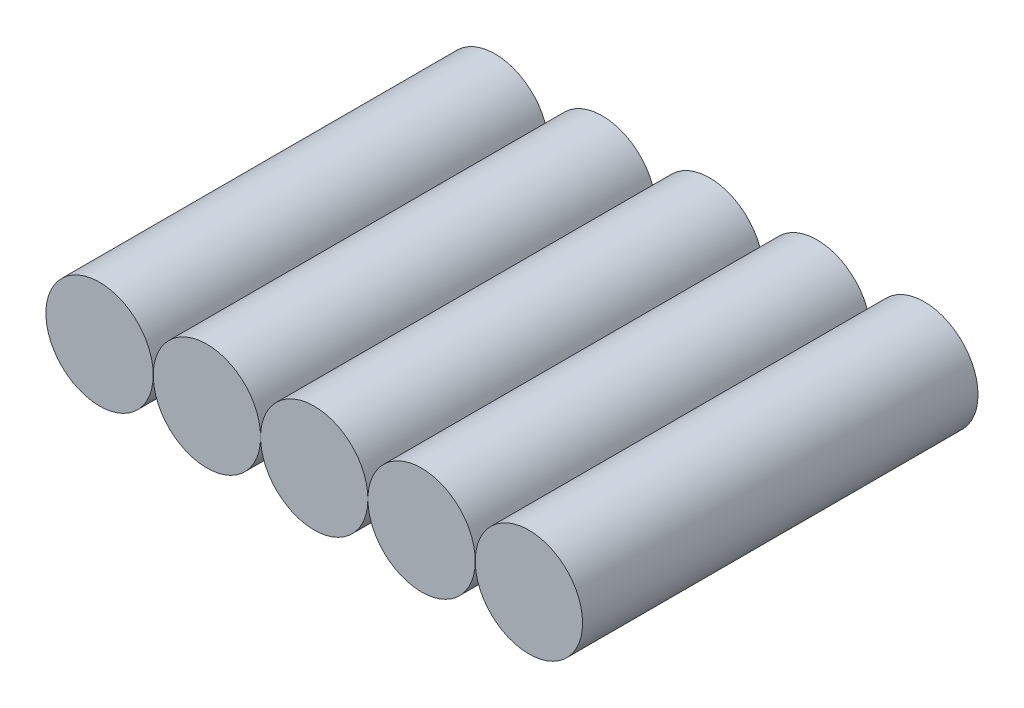
ISO-10303-21;
HEADER;
FILE_DESCRIPTION(('STEP AP214'),'2;1');
FILE_NAME('part.step','',(''),(''),'','','');
FILE_SCHEMA(('AUTOMOTIVE_DESIGN { 1 0 10303 214 1 1 1 1 }'));
ENDSEC;
DATA;
#1=APPLICATION_CONTEXT('core data for automotive mechanical design processes');
#2=APPLICATION_PROTOCOL_DEFINITION('international standard','automotive_design',2000,#1);
#3=PRODUCT_CONTEXT('',#1,'mechanical');
#4=PRODUCT('Part','Part','',(#3));
#5=PRODUCT_RELATED_PRODUCT_CATEGORY('part','',(#4));
#6=PRODUCT_DEFINITION_FORMATION('','',#4);
#7=PRODUCT_DEFINITION_CONTEXT('part definition',#1,'design');
#8=PRODUCT_DEFINITION('design','',#6,#7);
#9=PRODUCT_DEFINITION_SHAPE('','',#8);
#10=(LENGTH_UNIT() NAMED_UNIT(*) SI_UNIT(.MILLI.,.METRE.));
#11=(NAMED_UNIT(*) PLANE_ANGLE_UNIT() SI_UNIT($,.RADIAN.));
#12=(NAMED_UNIT(*) SI_UNIT($,.STERADIAN.) SOLID_ANGLE_UNIT());
#13=UNCERTAINTY_MEASURE_WITH_UNIT(LENGTH_MEASURE(1.E-05),#10,'distance_accuracy_value','');
#14=(GEOMETRIC_REPRESENTATION_CONTEXT(3) GLOBAL_UNCERTAINTY_ASSIGNED_CONTEXT((#13)) GLOBAL_UNIT_ASSIGNED_CONTEXT((#10,
#11,#12)) REPRESENTATION_CONTEXT('',''));
#15=CARTESIAN_POINT('',(0.,0.,0.));
#16=DIRECTION('',(0.,0.,1.));
#17=DIRECTION('',(1.,0.,0.));
#18=AXIS2_PLACEMENT_3D('',#15,#16,#17);
#19=CARTESIAN_POINT('',(38.,0.,-35.));
#20=DIRECTION('',(0.,0.,1.));
#21=DIRECTION('',(1.,0.,0.));
#22=AXIS2_PLACEMENT_3D('',#19,#20,#21);
#23=CYLINDRICAL_SURFACE('',#22,9.5);
#24=CARTESIAN_POINT('',(38.,0.,-35.));
#25=DIRECTION('',(0.,0.,1.));
#26=DIRECTION('',(1.,0.,0.));
#27=AXIS2_PLACEMENT_3D('',#24,#25,#26);
#28=CIRCLE('',#27,9.5);
#29=CARTESIAN_POINT('',(47.5,0.,-35.));
#30=VERTEX_POINT('',#29);
#31=EDGE_CURVE('E12',#30,#30,#28,.T.);
#32=ORIENTED_EDGE('',*,*,#31,.T.);
#33=EDGE_LOOP('',(#32));
#34=FACE_BOUND('',#33,.T.);
#35=CARTESIAN_POINT('',(38.,0.,35.));
#36=DIRECTION('',(0.,0.,1.));
#37=DIRECTION('',(1.,0.,0.));
#38=AXIS2_PLACEMENT_3D('',#35,#36,#37);
#39=CIRCLE('',#38,9.5);
#40=CARTESIAN_POINT('',(47.5,0.,35.));
#41=VERTEX_POINT('',#40);
#42=EDGE_CURVE('E71',#41,#41,#39,.T.);
#43=ORIENTED_EDGE('',*,*,#42,.F.);
#44=EDGE_LOOP('',(#43));
#45=FACE_BOUND('',#44,.T.);
#46=ADVANCED_FACE('F65',(#34,#45),#23,.T.);
#47=CARTESIAN_POINT('',(0.,0.,-35.));
#48=DIRECTION('',(0.,0.,1.));
#49=DIRECTION('',(1.,0.,0.));
#50=AXIS2_PLACEMENT_3D('',#47,#48,#49);
#51=PLANE('',#50);
#52=ORIENTED_EDGE('',*,*,#31,.F.);
#53=EDGE_LOOP('',(#52));
#54=FACE_BOUND('',#53,.T.);
#55=ADVANCED_FACE('F80',(#54),#51,.F.);
#56=CARTESIAN_POINT('',(0.,0.,35.));
#57=DIRECTION('',(0.,0.,1.));
#58=DIRECTION('',(1.,0.,0.));
#59=AXIS2_PLACEMENT_3D('',#56,#57,#58);
#60=PLANE('',#59);
#61=ORIENTED_EDGE('',*,*,#42,.T.);
#62=EDGE_LOOP('',(#61));
#63=FACE_BOUND('',#62,.T.);
#64=ADVANCED_FACE('F77',(#63),#60,.T.);
#65=CLOSED_SHELL('',(#46,#55,#64));
#66=MANIFOLD_SOLID_BREP('B2',#65);
#67=CARTESIAN_POINT('',(-38.,0.,-35.));
#68=DIRECTION('',(0.,0.,1.));
#69=DIRECTION('',(1.,0.,0.));
#70=AXIS2_PLACEMENT_3D('',#67,#68,#69);
#71=CYLINDRICAL_SURFACE('',#70,9.5);
#72=CARTESIAN_POINT('',(-38.,0.,-35.));
#73=DIRECTION('',(0.,0.,1.));
#74=DIRECTION('',(1.,0.,0.));
#75=AXIS2_PLACEMENT_3D('',#72,#73,#74);
#76=CIRCLE('',#75,9.5);
#77=CARTESIAN_POINT('',(-28.5,0.,-35.));
#78=VERTEX_POINT('',#77);
#79=EDGE_CURVE('E64',#78,#78,#76,.T.);
#80=ORIENTED_EDGE('',*,*,#79,.T.);
#81=EDGE_LOOP('',(#80));
#82=FACE_BOUND('',#81,.T.);
#83=CARTESIAN_POINT('',(-38.,0.,35.));
#84=DIRECTION('',(0.,0.,1.));
#85=DIRECTION('',(1.,0.,0.));
#86=AXIS2_PLACEMENT_3D('',#83,#84,#85);
#87=CIRCLE('',#86,9.5);
#88=CARTESIAN_POINT('',(-28.5,0.,35.));
#89=VERTEX_POINT('',#88);
#90=EDGE_CURVE('E125',#89,#89,#87,.T.);
#91=ORIENTED_EDGE('',*,*,#90,.F.);
#92=EDGE_LOOP('',(#91));
#93=FACE_BOUND('',#92,.T.);
#94=ADVANCED_FACE('F119',(#82,#93),#71,.T.);
#95=CARTESIAN_POINT('',(0.,0.,-35.));
#96=DIRECTION('',(0.,0.,1.));
#97=DIRECTION('',(1.,0.,0.));
#98=AXIS2_PLACEMENT_3D('',#95,#96,#97);
#99=PLANE('',#98);
#100=ORIENTED_EDGE('',*,*,#79,.F.);
#101=EDGE_LOOP('',(#100));
#102=FACE_BOUND('',#101,.T.);
#103=ADVANCED_FACE('F134',(#102),#99,.F.);
#104=CARTESIAN_POINT('',(0.,0.,35.));
#105=DIRECTION('',(0.,0.,1.));
#106=DIRECTION('',(1.,0.,0.));
#107=AXIS2_PLACEMENT_3D('',#104,#105,#106);
#108=PLANE('',#107);
#109=ORIENTED_EDGE('',*,*,#90,.T.);
#110=EDGE_LOOP('',(#109));
#111=FACE_BOUND('',#110,.T.);
#112=ADVANCED_FACE('F131',(#111),#108,.T.);
#113=CLOSED_SHELL('',(#94,#103,#112));
#114=MANIFOLD_SOLID_BREP('B7',#113);
#115=CARTESIAN_POINT('',(-19.,0.,-35.));
#116=DIRECTION('',(0.,0.,1.));
#117=DIRECTION('',(1.,0.,0.));
#118=AXIS2_PLACEMENT_3D('',#115,#116,#117);
#119=CYLINDRICAL_SURFACE('',#118,9.5);
#120=CARTESIAN_POINT('',(-19.,0.,-35.));
#121=DIRECTION('',(0.,0.,1.));
#122=DIRECTION('',(1.,0.,0.));
#123=AXIS2_PLACEMENT_3D('',#120,#121,#122);
#124=CIRCLE('',#123,9.5);
#125=CARTESIAN_POINT('',(-9.5,0.,-35.));
#126=VERTEX_POINT('',#125);
#127=EDGE_CURVE('E118',#126,#126,#124,.T.);
#128=ORIENTED_EDGE('',*,*,#127,.T.);
#129=EDGE_LOOP('',(#128));
#130=FACE_BOUND('',#129,.T.);
#131=CARTESIAN_POINT('',(-19.,0.,35.));
#132=DIRECTION('',(0.,0.,1.));
#133=DIRECTION('',(1.,0.,0.));
#134=AXIS2_PLACEMENT_3D('',#131,#132,#133);
#135=CIRCLE('',#134,9.5);
#136=CARTESIAN_POINT('',(-9.5,0.,35.));
#137=VERTEX_POINT('',#136);
#138=EDGE_CURVE('E179',#137,#137,#135,.T.);
#139=ORIENTED_EDGE('',*,*,#138,.F.);
#140=EDGE_LOOP('',(#139));
#141=FACE_BOUND('',#140,.T.);
#142=ADVANCED_FACE('F173',(#130,#141),#119,.T.);
#143=CARTESIAN_POINT('',(0.,0.,-35.));
#144=DIRECTION('',(0.,0.,1.));
#145=DIRECTION('',(1.,0.,0.));
#146=AXIS2_PLACEMENT_3D('',#143,#144,#145);
#147=PLANE('',#146);
#148=ORIENTED_EDGE('',*,*,#127,.F.);
#149=EDGE_LOOP('',(#148));
#150=FACE_BOUND('',#149,.T.);
#151=ADVANCED_FACE('F188',(#150),#147,.F.);
#152=CARTESIAN_POINT('',(0.,0.,35.));
#153=DIRECTION('',(0.,0.,1.));
#154=DIRECTION('',(1.,0.,0.));
#155=AXIS2_PLACEMENT_3D('',#152,#153,#154);
#156=PLANE('',#155);
#157=ORIENTED_EDGE('',*,*,#138,.T.);
#158=EDGE_LOOP('',(#157));
#159=FACE_BOUND('',#158,.T.);
#160=ADVANCED_FACE('F185',(#159),#156,.T.);
#161=CLOSED_SHELL('',(#142,#151,#160));
#162=MANIFOLD_SOLID_BREP('B59',#161);
#163=CARTESIAN_POINT('',(0.,0.,-35.));
#164=DIRECTION('',(0.,0.,1.));
#165=DIRECTION('',(1.,0.,0.));
#166=AXIS2_PLACEMENT_3D('',#163,#164,#165);
#167=CYLINDRICAL_SURFACE('',#166,9.5);
#168=CARTESIAN_POINT('',(0.,0.,-35.));
#169=DIRECTION('',(0.,0.,1.));
#170=DIRECTION('',(1.,0.,0.));
#171=AXIS2_PLACEMENT_3D('',#168,#169,#170);
#172=CIRCLE('',#171,9.5);
#173=CARTESIAN_POINT('',(9.5,0.,-35.));
#174=VERTEX_POINT('',#173);
#175=EDGE_CURVE('E172',#174,#174,#172,.T.);
#176=ORIENTED_EDGE('',*,*,#175,.T.);
#177=EDGE_LOOP('',(#176));
#178=FACE_BOUND('',#177,.T.);
#179=CARTESIAN_POINT('',(0.,0.,35.));
#180=DIRECTION('',(0.,0.,1.));
#181=DIRECTION('',(1.,0.,0.));
#182=AXIS2_PLACEMENT_3D('',#179,#180,#181);
#183=CIRCLE('',#182,9.5);
#184=CARTESIAN_POINT('',(9.5,0.,35.));
#185=VERTEX_POINT('',#184);
#186=EDGE_CURVE('E232',#185,#185,#183,.T.);
#187=ORIENTED_EDGE('',*,*,#186,.F.);
#188=EDGE_LOOP('',(#187));
#189=FACE_BOUND('',#188,.T.);
#190=ADVANCED_FACE('F226',(#178,#189),#167,.T.);
#191=CARTESIAN_POINT('',(0.,0.,-35.));
#192=DIRECTION('',(0.,0.,1.));
#193=DIRECTION('',(1.,0.,0.));
#194=AXIS2_PLACEMENT_3D('',#191,#192,#193);
#195=PLANE('',#194);
#196=ORIENTED_EDGE('',*,*,#175,.F.);
#197=EDGE_LOOP('',(#196));
#198=FACE_BOUND('',#197,.T.);
#199=ADVANCED_FACE('F241',(#198),#195,.F.);
#200=CARTESIAN_POINT('',(0.,0.,35.));
#201=DIRECTION('',(0.,0.,1.));
#202=DIRECTION('',(1.,0.,0.));
#203=AXIS2_PLACEMENT_3D('',#200,#201,#202);
#204=PLANE('',#203);
#205=ORIENTED_EDGE('',*,*,#186,.T.);
#206=EDGE_LOOP('',(#205));
#207=FACE_BOUND('',#206,.T.);
#208=ADVANCED_FACE('F238',(#207),#204,.T.);
#209=CLOSED_SHELL('',(#190,#199,#208));
#210=MANIFOLD_SOLID_BREP('B113',#209);
#211=CARTESIAN_POINT('',(19.,0.,-35.));
#212=DIRECTION('',(0.,0.,1.));
#213=DIRECTION('',(1.,0.,0.));
#214=AXIS2_PLACEMENT_3D('',#211,#212,#213);
#215=CYLINDRICAL_SURFACE('',#214,9.5);
#216=CARTESIAN_POINT('',(19.,0.,-35.));
#217=DIRECTION('',(0.,0.,1.));
#218=DIRECTION('',(1.,0.,0.));
#219=AXIS2_PLACEMENT_3D('',#216,#217,#218);
#220=CIRCLE('',#219,9.5);
#221=CARTESIAN_POINT('',(28.5,0.,-35.));
#222=VERTEX_POINT('',#221);
#223=EDGE_CURVE('E225',#222,#222,#220,.T.);
#224=ORIENTED_EDGE('',*,*,#223,.T.);
#225=EDGE_LOOP('',(#224));
#226=FACE_BOUND('',#225,.T.);
#227=CARTESIAN_POINT('',(19.,0.,35.));
#228=DIRECTION('',(0.,0.,1.));
#229=DIRECTION('',(1.,0.,0.));
#230=AXIS2_PLACEMENT_3D('',#227,#228,#229);
#231=CIRCLE('',#230,9.5);
#232=CARTESIAN_POINT('',(28.5,0.,35.));
#233=VERTEX_POINT('',#232);
#234=EDGE_CURVE('E278',#233,#233,#231,.T.);
#235=ORIENTED_EDGE('',*,*,#234,.F.);
#236=EDGE_LOOP('',(#235));
#237=FACE_BOUND('',#236,.T.);
#238=ADVANCED_FACE('F272',(#226,#237),#215,.T.);
#239=CARTESIAN_POINT('',(0.,0.,-35.));
#240=DIRECTION('',(0.,0.,1.));
#241=DIRECTION('',(1.,0.,0.));
#242=AXIS2_PLACEMENT_3D('',#239,#240,#241);
#243=PLANE('',#242);
#244=ORIENTED_EDGE('',*,*,#223,.F.);
#245=EDGE_LOOP('',(#244));
#246=FACE_BOUND('',#245,.T.);
#247=ADVANCED_FACE('F287',(#246),#243,.F.);
#248=CARTESIAN_POINT('',(0.,0.,35.));
#249=DIRECTION('',(0.,0.,1.));
#250=DIRECTION('',(1.,0.,0.));
#251=AXIS2_PLACEMENT_3D('',#248,#249,#250);
#252=PLANE('',#251);
#253=ORIENTED_EDGE('',*,*,#234,.T.);
#254=EDGE_LOOP('',(#253));
#255=FACE_BOUND('',#254,.T.);
#256=ADVANCED_FACE('F284',(#255),#252,.T.);
#257=CLOSED_SHELL('',(#238,#247,#256));
#258=MANIFOLD_SOLID_BREP('B167',#257);
#259=ADVANCED_BREP_SHAPE_REPRESENTATION('',(#18,#66,#114,#162,#210,#258),#14);
#260=SHAPE_DEFINITION_REPRESENTATION(#9,#259);
ENDSEC;
END-ISO-10303-21;
